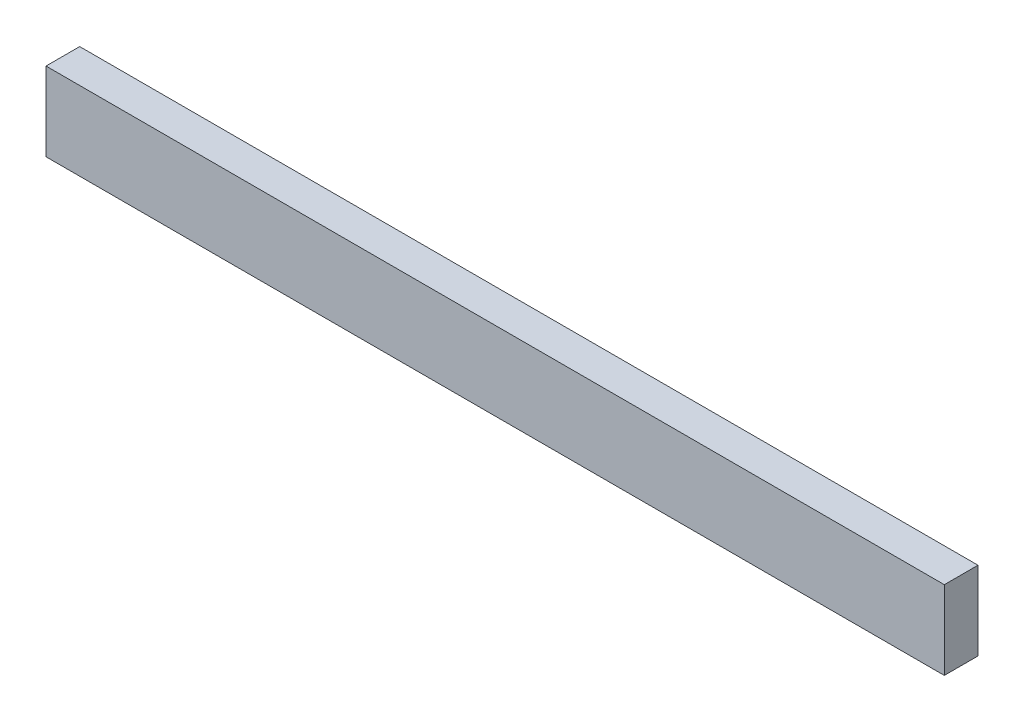
ISO-10303-21;
HEADER;
FILE_DESCRIPTION(('STEP AP214'),'2;1');
FILE_NAME('part.step','',(''),(''),'','','');
FILE_SCHEMA(('AUTOMOTIVE_DESIGN { 1 0 10303 214 1 1 1 1 }'));
ENDSEC;
DATA;
#1=APPLICATION_CONTEXT('core data for automotive mechanical design processes');
#2=APPLICATION_PROTOCOL_DEFINITION('international standard','automotive_design',2000,#1);
#3=PRODUCT_CONTEXT('',#1,'mechanical');
#4=PRODUCT('Part','Part','',(#3));
#5=PRODUCT_RELATED_PRODUCT_CATEGORY('part','',(#4));
#6=PRODUCT_DEFINITION_FORMATION('','',#4);
#7=PRODUCT_DEFINITION_CONTEXT('part definition',#1,'design');
#8=PRODUCT_DEFINITION('design','',#6,#7);
#9=PRODUCT_DEFINITION_SHAPE('','',#8);
#10=(LENGTH_UNIT() NAMED_UNIT(*) SI_UNIT(.MILLI.,.METRE.));
#11=(NAMED_UNIT(*) PLANE_ANGLE_UNIT() SI_UNIT($,.RADIAN.));
#12=(NAMED_UNIT(*) SI_UNIT($,.STERADIAN.) SOLID_ANGLE_UNIT());
#13=UNCERTAINTY_MEASURE_WITH_UNIT(LENGTH_MEASURE(1.E-05),#10,'distance_accuracy_value','');
#14=(GEOMETRIC_REPRESENTATION_CONTEXT(3) GLOBAL_UNCERTAINTY_ASSIGNED_CONTEXT((#13)) GLOBAL_UNIT_ASSIGNED_CONTEXT((#10,
#11,#12)) REPRESENTATION_CONTEXT('',''));
#15=CARTESIAN_POINT('',(0.,0.,0.));
#16=DIRECTION('',(0.,0.,1.));
#17=DIRECTION('',(1.,0.,0.));
#18=AXIS2_PLACEMENT_3D('',#15,#16,#17);
#19=CARTESIAN_POINT('',(-508.,-88.9,613.56875));
#20=DIRECTION('',(1.,0.,0.));
#21=DIRECTION('',(0.,0.,-1.));
#22=AXIS2_PLACEMENT_3D('',#19,#20,#21);
#23=PLANE('',#22);
#24=DIRECTION('',(0.,0.,-1.));
#25=VECTOR('',#24,1.);
#26=CARTESIAN_POINT('',(-508.,0.,613.56875));
#27=LINE('',#26,#25);
#28=CARTESIAN_POINT('',(-508.,0.,613.56875));
#29=VERTEX_POINT('',#28);
#30=CARTESIAN_POINT('',(-508.,0.,575.46875));
#31=VERTEX_POINT('',#30);
#32=EDGE_CURVE('E109',#29,#31,#27,.T.);
#33=ORIENTED_EDGE('',*,*,#32,.T.);
#34=DIRECTION('',(0.,1.,0.));
#35=VECTOR('',#34,1.);
#36=CARTESIAN_POINT('',(-508.,-88.9,575.46875));
#37=LINE('',#36,#35);
#38=CARTESIAN_POINT('',(-508.,-88.9,575.46875));
#39=VERTEX_POINT('',#38);
#40=EDGE_CURVE('E11',#39,#31,#37,.T.);
#41=ORIENTED_EDGE('',*,*,#40,.F.);
#42=DIRECTION('',(0.,0.,-1.));
#43=VECTOR('',#42,1.);
#44=CARTESIAN_POINT('',(-508.,-88.9,613.56875));
#45=LINE('',#44,#43);
#46=CARTESIAN_POINT('',(-508.,-88.9,613.56875));
#47=VERTEX_POINT('',#46);
#48=EDGE_CURVE('E92',#47,#39,#45,.T.);
#49=ORIENTED_EDGE('',*,*,#48,.F.);
#50=DIRECTION('',(0.,1.,0.));
#51=VECTOR('',#50,1.);
#52=CARTESIAN_POINT('',(-508.,-88.9,613.56875));
#53=LINE('',#52,#51);
#54=EDGE_CURVE('E105',#47,#29,#53,.T.);
#55=ORIENTED_EDGE('',*,*,#54,.T.);
#56=EDGE_LOOP('',(#33,#41,#49,#55));
#57=FACE_BOUND('',#56,.T.);
#58=ADVANCED_FACE('F40',(#57),#23,.F.);
#59=CARTESIAN_POINT('',(-508.,-88.9,575.46875));
#60=DIRECTION('',(0.,0.,1.));
#61=DIRECTION('',(1.,0.,0.));
#62=AXIS2_PLACEMENT_3D('',#59,#60,#61);
#63=PLANE('',#62);
#64=DIRECTION('',(1.,0.,0.));
#65=VECTOR('',#64,1.);
#66=CARTESIAN_POINT('',(-508.,0.,575.46875));
#67=LINE('',#66,#65);
#68=CARTESIAN_POINT('',(508.,0.,575.46875));
#69=VERTEX_POINT('',#68);
#70=EDGE_CURVE('E97',#31,#69,#67,.T.);
#71=ORIENTED_EDGE('',*,*,#70,.T.);
#72=DIRECTION('',(0.,1.,0.));
#73=VECTOR('',#72,1.);
#74=CARTESIAN_POINT('',(508.,-88.9,575.46875));
#75=LINE('',#74,#73);
#76=CARTESIAN_POINT('',(508.,-88.9,575.46875));
#77=VERTEX_POINT('',#76);
#78=EDGE_CURVE('E49',#77,#69,#75,.T.);
#79=ORIENTED_EDGE('',*,*,#78,.F.);
#80=DIRECTION('',(1.,0.,0.));
#81=VECTOR('',#80,1.);
#82=CARTESIAN_POINT('',(-508.,-88.9,575.46875));
#83=LINE('',#82,#81);
#84=EDGE_CURVE('E87',#39,#77,#83,.T.);
#85=ORIENTED_EDGE('',*,*,#84,.F.);
#86=ORIENTED_EDGE('',*,*,#40,.T.);
#87=EDGE_LOOP('',(#71,#79,#85,#86));
#88=FACE_BOUND('',#87,.T.);
#89=ADVANCED_FACE('F96',(#88),#63,.F.);
#90=CARTESIAN_POINT('',(508.,-88.9,613.56875));
#91=DIRECTION('',(-1.,0.,0.));
#92=DIRECTION('',(0.,0.,1.));
#93=AXIS2_PLACEMENT_3D('',#90,#91,#92);
#94=PLANE('',#93);
#95=DIRECTION('',(0.,0.,1.));
#96=VECTOR('',#95,1.);
#97=CARTESIAN_POINT('',(508.,0.,613.56875));
#98=LINE('',#97,#96);
#99=CARTESIAN_POINT('',(508.,0.,613.56875));
#100=VERTEX_POINT('',#99);
#101=EDGE_CURVE('E74',#69,#100,#98,.T.);
#102=ORIENTED_EDGE('',*,*,#101,.T.);
#103=DIRECTION('',(0.,1.,0.));
#104=VECTOR('',#103,1.);
#105=CARTESIAN_POINT('',(508.,-88.9,613.56875));
#106=LINE('',#105,#104);
#107=CARTESIAN_POINT('',(508.,-88.9,613.56875));
#108=VERTEX_POINT('',#107);
#109=EDGE_CURVE('E99',#108,#100,#106,.T.);
#110=ORIENTED_EDGE('',*,*,#109,.F.);
#111=DIRECTION('',(0.,0.,1.));
#112=VECTOR('',#111,1.);
#113=CARTESIAN_POINT('',(508.,-88.9,613.56875));
#114=LINE('',#113,#112);
#115=EDGE_CURVE('E90',#77,#108,#114,.T.);
#116=ORIENTED_EDGE('',*,*,#115,.F.);
#117=ORIENTED_EDGE('',*,*,#78,.T.);
#118=EDGE_LOOP('',(#102,#110,#116,#117));
#119=FACE_BOUND('',#118,.T.);
#120=ADVANCED_FACE('F100',(#119),#94,.F.);
#121=CARTESIAN_POINT('',(-508.,-88.9,613.56875));
#122=DIRECTION('',(0.,0.,-1.));
#123=DIRECTION('',(-1.,0.,0.));
#124=AXIS2_PLACEMENT_3D('',#121,#122,#123);
#125=PLANE('',#124);
#126=DIRECTION('',(-1.,0.,0.));
#127=VECTOR('',#126,1.);
#128=CARTESIAN_POINT('',(-508.,0.,613.56875));
#129=LINE('',#128,#127);
#130=EDGE_CURVE('E80',#100,#29,#129,.T.);
#131=ORIENTED_EDGE('',*,*,#130,.T.);
#132=ORIENTED_EDGE('',*,*,#54,.F.);
#133=DIRECTION('',(-1.,0.,0.));
#134=VECTOR('',#133,1.);
#135=CARTESIAN_POINT('',(-508.,-88.9,613.56875));
#136=LINE('',#135,#134);
#137=EDGE_CURVE('E57',#108,#47,#136,.T.);
#138=ORIENTED_EDGE('',*,*,#137,.F.);
#139=ORIENTED_EDGE('',*,*,#109,.T.);
#140=EDGE_LOOP('',(#131,#132,#138,#139));
#141=FACE_BOUND('',#140,.T.);
#142=ADVANCED_FACE('F123',(#141),#125,.F.);
#143=CARTESIAN_POINT('',(0.,-88.9,0.));
#144=DIRECTION('',(0.,-1.,0.));
#145=DIRECTION('',(0.,0.,-1.));
#146=AXIS2_PLACEMENT_3D('',#143,#144,#145);
#147=PLANE('',#146);
#148=ORIENTED_EDGE('',*,*,#48,.T.);
#149=ORIENTED_EDGE('',*,*,#84,.T.);
#150=ORIENTED_EDGE('',*,*,#115,.T.);
#151=ORIENTED_EDGE('',*,*,#137,.T.);
#152=EDGE_LOOP('',(#148,#149,#150,#151));
#153=FACE_BOUND('',#152,.T.);
#154=ADVANCED_FACE('F88',(#153),#147,.T.);
#155=CARTESIAN_POINT('',(0.,0.,0.));
#156=DIRECTION('',(0.,-1.,0.));
#157=DIRECTION('',(0.,0.,-1.));
#158=AXIS2_PLACEMENT_3D('',#155,#156,#157);
#159=PLANE('',#158);
#160=ORIENTED_EDGE('',*,*,#32,.F.);
#161=ORIENTED_EDGE('',*,*,#130,.F.);
#162=ORIENTED_EDGE('',*,*,#101,.F.);
#163=ORIENTED_EDGE('',*,*,#70,.F.);
#164=EDGE_LOOP('',(#160,#161,#162,#163));
#165=FACE_BOUND('',#164,.T.);
#166=ADVANCED_FACE('F126',(#165),#159,.F.);
#167=CLOSED_SHELL('',(#58,#89,#120,#142,#154,#166));
#168=MANIFOLD_SOLID_BREP('B2',#167);
#169=ADVANCED_BREP_SHAPE_REPRESENTATION('',(#18,#168),#14);
#170=SHAPE_DEFINITION_REPRESENTATION(#9,#169);
ENDSEC;
END-ISO-10303-21;
